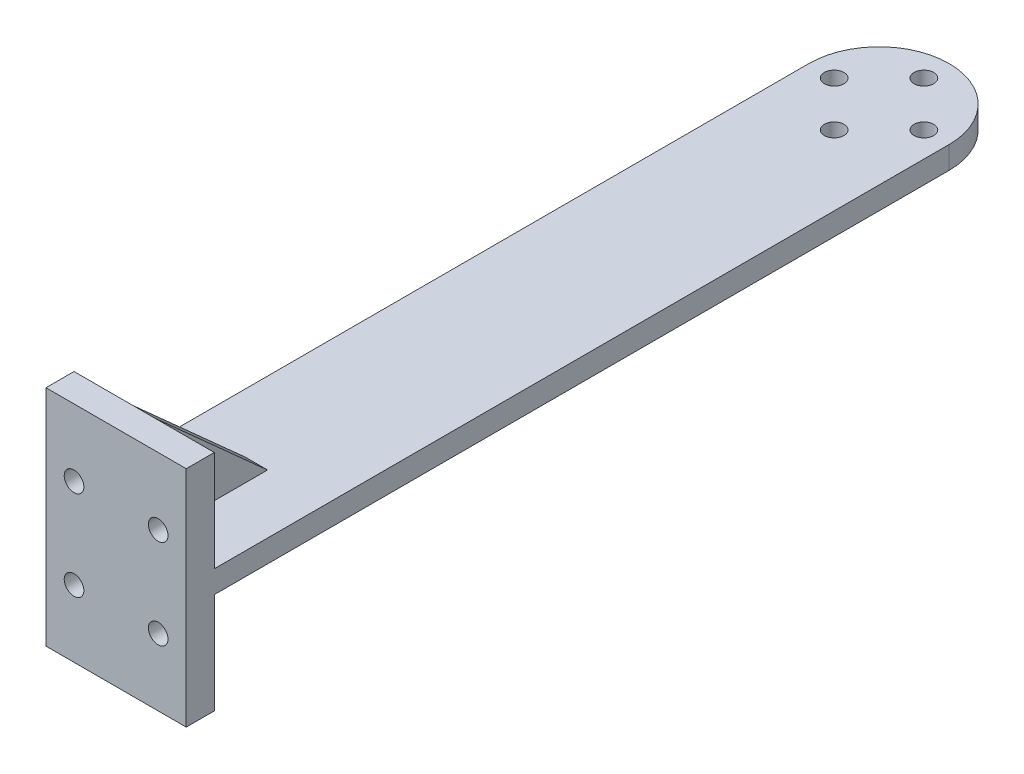
ISO-10303-21;
HEADER;
FILE_DESCRIPTION(('STEP AP214'),'2;1');
FILE_NAME('part.step','',(''),(''),'','','');
FILE_SCHEMA(('AUTOMOTIVE_DESIGN { 1 0 10303 214 1 1 1 1 }'));
ENDSEC;
DATA;
#1=APPLICATION_CONTEXT('core data for automotive mechanical design processes');
#2=APPLICATION_PROTOCOL_DEFINITION('international standard','automotive_design',2000,#1);
#3=PRODUCT_CONTEXT('',#1,'mechanical');
#4=PRODUCT('Part','Part','',(#3));
#5=PRODUCT_RELATED_PRODUCT_CATEGORY('part','',(#4));
#6=PRODUCT_DEFINITION_FORMATION('','',#4);
#7=PRODUCT_DEFINITION_CONTEXT('part definition',#1,'design');
#8=PRODUCT_DEFINITION('design','',#6,#7);
#9=PRODUCT_DEFINITION_SHAPE('','',#8);
#10=(LENGTH_UNIT() NAMED_UNIT(*) SI_UNIT(.MILLI.,.METRE.));
#11=(NAMED_UNIT(*) PLANE_ANGLE_UNIT() SI_UNIT($,.RADIAN.));
#12=(NAMED_UNIT(*) SI_UNIT($,.STERADIAN.) SOLID_ANGLE_UNIT());
#13=UNCERTAINTY_MEASURE_WITH_UNIT(LENGTH_MEASURE(1.E-05),#10,'distance_accuracy_value','');
#14=(GEOMETRIC_REPRESENTATION_CONTEXT(3) GLOBAL_UNCERTAINTY_ASSIGNED_CONTEXT((#13)) GLOBAL_UNIT_ASSIGNED_CONTEXT((#10,
#11,#12)) REPRESENTATION_CONTEXT('',''));
#15=CARTESIAN_POINT('',(0.,0.,0.));
#16=DIRECTION('',(0.,0.,1.));
#17=DIRECTION('',(1.,0.,0.));
#18=AXIS2_PLACEMENT_3D('',#15,#16,#17);
#19=CARTESIAN_POINT('',(0.,-17.95,0.));
#20=DIRECTION('',(0.,1.,0.));
#21=DIRECTION('',(0.,0.,-1.));
#22=AXIS2_PLACEMENT_3D('',#19,#20,#21);
#23=PLANE('',#22);
#24=DIRECTION('',(1.,0.,0.));
#25=VECTOR('',#24,1.);
#26=CARTESIAN_POINT('',(0.,-17.95,-5.));
#27=LINE('',#26,#25);
#28=CARTESIAN_POINT('',(10.5,-17.95,-5.));
#29=VERTEX_POINT('',#28);
#30=CARTESIAN_POINT('',(14.5,-17.95,-5.));
#31=VERTEX_POINT('',#30);
#32=EDGE_CURVE('E152',#29,#31,#27,.T.);
#33=ORIENTED_EDGE('',*,*,#32,.T.);
#34=DIRECTION('',(-1.,0.,0.));
#35=VECTOR('',#34,1.);
#36=CARTESIAN_POINT('',(0.,-17.95,-5.));
#37=LINE('',#36,#35);
#38=CARTESIAN_POINT('',(25.,-17.95,-5.));
#39=VERTEX_POINT('',#38);
#40=EDGE_CURVE('E181',#39,#31,#37,.T.);
#41=ORIENTED_EDGE('',*,*,#40,.F.);
#42=DIRECTION('',(0.,0.,-1.));
#43=VECTOR('',#42,1.);
#44=CARTESIAN_POINT('',(25.,-17.95,0.));
#45=LINE('',#44,#43);
#46=CARTESIAN_POINT('',(25.,-17.95,0.));
#47=VERTEX_POINT('',#46);
#48=EDGE_CURVE('E184',#47,#39,#45,.T.);
#49=ORIENTED_EDGE('',*,*,#48,.F.);
#50=DIRECTION('',(1.,0.,0.));
#51=VECTOR('',#50,1.);
#52=CARTESIAN_POINT('',(0.,-17.95,0.));
#53=LINE('',#52,#51);
#54=CARTESIAN_POINT('',(0.,-17.95,0.));
#55=VERTEX_POINT('',#54);
#56=EDGE_CURVE('E187',#55,#47,#53,.T.);
#57=ORIENTED_EDGE('',*,*,#56,.F.);
#58=DIRECTION('',(0.,0.,1.));
#59=VECTOR('',#58,1.);
#60=CARTESIAN_POINT('',(0.,-17.95,0.));
#61=LINE('',#60,#59);
#62=CARTESIAN_POINT('',(0.,-17.95,-5.));
#63=VERTEX_POINT('',#62);
#64=EDGE_CURVE('E177',#63,#55,#61,.T.);
#65=ORIENTED_EDGE('',*,*,#64,.F.);
#66=EDGE_CURVE('E180',#29,#63,#37,.T.);
#67=ORIENTED_EDGE('',*,*,#66,.F.);
#68=EDGE_LOOP('',(#33,#41,#49,#57,#65,#67));
#69=FACE_BOUND('',#68,.T.);
#70=ADVANCED_FACE('F38',(#69),#23,.F.);
#71=CARTESIAN_POINT('',(14.5,-17.95,-25.));
#72=DIRECTION('',(1.,0.,0.));
#73=DIRECTION('',(0.,1.,0.));
#74=AXIS2_PLACEMENT_3D('',#71,#72,#73);
#75=PLANE('',#74);
#76=DIRECTION('',(0.,1.,0.));
#77=VECTOR('',#76,1.);
#78=CARTESIAN_POINT('',(14.5,-17.95,-5.));
#79=LINE('',#78,#77);
#80=CARTESIAN_POINT('',(14.5,0.,-5.));
#81=VERTEX_POINT('',#80);
#82=EDGE_CURVE('E151',#31,#81,#79,.T.);
#83=ORIENTED_EDGE('',*,*,#82,.F.);
#84=DIRECTION('',(0.,0.667936165722797,-0.74421856905047));
#85=VECTOR('',#84,1.);
#86=CARTESIAN_POINT('',(14.5,0.,-25.));
#87=LINE('',#86,#85);
#88=CARTESIAN_POINT('',(14.5,0.,-25.));
#89=VERTEX_POINT('',#88);
#90=EDGE_CURVE('E141',#31,#89,#87,.T.);
#91=ORIENTED_EDGE('',*,*,#90,.T.);
#92=DIRECTION('',(0.,0.,1.));
#93=VECTOR('',#92,1.);
#94=CARTESIAN_POINT('',(14.5,0.,-25.));
#95=LINE('',#94,#93);
#96=EDGE_CURVE('E144',#89,#81,#95,.T.);
#97=ORIENTED_EDGE('',*,*,#96,.T.);
#98=EDGE_LOOP('',(#83,#91,#97));
#99=FACE_BOUND('',#98,.T.);
#100=ADVANCED_FACE('F150',(#99),#75,.T.);
#101=CARTESIAN_POINT('',(10.5,-17.95,-25.));
#102=DIRECTION('',(-1.,0.,0.));
#103=DIRECTION('',(0.,0.,1.));
#104=AXIS2_PLACEMENT_3D('',#101,#102,#103);
#105=PLANE('',#104);
#106=DIRECTION('',(0.,0.,1.));
#107=VECTOR('',#106,1.);
#108=CARTESIAN_POINT('',(10.5,0.,-25.));
#109=LINE('',#108,#107);
#110=CARTESIAN_POINT('',(10.5,0.,-25.));
#111=VERTEX_POINT('',#110);
#112=CARTESIAN_POINT('',(10.5,0.,-5.));
#113=VERTEX_POINT('',#112);
#114=EDGE_CURVE('E62',#111,#113,#109,.T.);
#115=ORIENTED_EDGE('',*,*,#114,.F.);
#116=DIRECTION('',(0.,-0.667936165722797,0.74421856905047));
#117=VECTOR('',#116,1.);
#118=CARTESIAN_POINT('',(10.5,-8.00819005057446,-16.0772255703906));
#119=LINE('',#118,#117);
#120=EDGE_CURVE('E55',#111,#29,#119,.T.);
#121=ORIENTED_EDGE('',*,*,#120,.T.);
#122=DIRECTION('',(0.,-1.,0.));
#123=VECTOR('',#122,1.);
#124=CARTESIAN_POINT('',(10.5,-17.95,-5.));
#125=LINE('',#124,#123);
#126=EDGE_CURVE('E145',#113,#29,#125,.T.);
#127=ORIENTED_EDGE('',*,*,#126,.F.);
#128=EDGE_LOOP('',(#115,#121,#127));
#129=FACE_BOUND('',#128,.T.);
#130=ADVANCED_FACE('F300',(#129),#105,.T.);
#131=CARTESIAN_POINT('',(0.,-17.95,-5.));
#132=DIRECTION('',(0.,0.,-1.));
#133=DIRECTION('',(-1.,0.,0.));
#134=AXIS2_PLACEMENT_3D('',#131,#132,#133);
#135=PLANE('',#134);
#136=ORIENTED_EDGE('',*,*,#82,.T.);
#137=DIRECTION('',(-1.,0.,0.));
#138=VECTOR('',#137,1.);
#139=CARTESIAN_POINT('',(0.,0.,-5.));
#140=LINE('',#139,#138);
#141=CARTESIAN_POINT('',(25.,0.,-5.));
#142=VERTEX_POINT('',#141);
#143=EDGE_CURVE('E158',#142,#81,#140,.T.);
#144=ORIENTED_EDGE('',*,*,#143,.F.);
#145=DIRECTION('',(0.,1.,0.));
#146=VECTOR('',#145,1.);
#147=CARTESIAN_POINT('',(25.,-17.95,-5.));
#148=LINE('',#147,#146);
#149=EDGE_CURVE('E190',#39,#142,#148,.T.);
#150=ORIENTED_EDGE('',*,*,#149,.F.);
#151=ORIENTED_EDGE('',*,*,#40,.T.);
#152=EDGE_LOOP('',(#136,#144,#150,#151));
#153=FACE_BOUND('',#152,.T.);
#154=CARTESIAN_POINT('',(20.,-6.,-5.));
#155=DIRECTION('',(0.,0.,1.));
#156=DIRECTION('',(-1.,0.,0.));
#157=AXIS2_PLACEMENT_3D('',#154,#155,#156);
#158=CIRCLE('',#157,1.75);
#159=CARTESIAN_POINT('',(18.25,-6.,-5.));
#160=VERTEX_POINT('',#159);
#161=EDGE_CURVE('E169',#160,#160,#158,.T.);
#162=ORIENTED_EDGE('',*,*,#161,.T.);
#163=EDGE_LOOP('',(#162));
#164=FACE_BOUND('',#163,.T.);
#165=ADVANCED_FACE('F311',(#153,#164),#135,.T.);
#166=CARTESIAN_POINT('',(12.5,4.,-136.));
#167=DIRECTION('',(0.,1.,0.));
#168=DIRECTION('',(0.,0.,1.));
#169=AXIS2_PLACEMENT_3D('',#166,#167,#168);
#170=PLANE('',#169);
#171=CARTESIAN_POINT('',(12.5,4.,-144.));
#172=DIRECTION('',(0.,1.,0.));
#173=DIRECTION('',(0.,0.,1.));
#174=AXIS2_PLACEMENT_3D('',#171,#172,#173);
#175=CIRCLE('',#174,1.75);
#176=CARTESIAN_POINT('',(12.5,4.,-142.25));
#177=VERTEX_POINT('',#176);
#178=EDGE_CURVE('E272',#177,#177,#175,.T.);
#179=ORIENTED_EDGE('',*,*,#178,.F.);
#180=EDGE_LOOP('',(#179));
#181=FACE_BOUND('',#180,.T.);
#182=CARTESIAN_POINT('',(20.5,4.,-136.));
#183=DIRECTION('',(0.,1.,0.));
#184=DIRECTION('',(0.,0.,1.));
#185=AXIS2_PLACEMENT_3D('',#182,#183,#184);
#186=CIRCLE('',#185,1.75000000000001);
#187=CARTESIAN_POINT('',(20.5,4.,-134.25));
#188=VERTEX_POINT('',#187);
#189=EDGE_CURVE('E414',#188,#188,#186,.T.);
#190=ORIENTED_EDGE('',*,*,#189,.F.);
#191=EDGE_LOOP('',(#190));
#192=FACE_BOUND('',#191,.T.);
#193=CARTESIAN_POINT('',(12.5,4.,-128.));
#194=DIRECTION('',(0.,1.,0.));
#195=DIRECTION('',(0.,0.,1.));
#196=AXIS2_PLACEMENT_3D('',#193,#194,#195);
#197=CIRCLE('',#196,1.75);
#198=CARTESIAN_POINT('',(12.5,4.,-126.25));
#199=VERTEX_POINT('',#198);
#200=EDGE_CURVE('E411',#199,#199,#197,.T.);
#201=ORIENTED_EDGE('',*,*,#200,.F.);
#202=EDGE_LOOP('',(#201));
#203=FACE_BOUND('',#202,.T.);
#204=CARTESIAN_POINT('',(4.5,4.,-136.));
#205=DIRECTION('',(0.,1.,0.));
#206=DIRECTION('',(0.,0.,1.));
#207=AXIS2_PLACEMENT_3D('',#204,#205,#206);
#208=CIRCLE('',#207,1.75000000000001);
#209=CARTESIAN_POINT('',(4.5,4.,-134.25));
#210=VERTEX_POINT('',#209);
#211=EDGE_CURVE('E408',#210,#210,#208,.T.);
#212=ORIENTED_EDGE('',*,*,#211,.F.);
#213=EDGE_LOOP('',(#212));
#214=FACE_BOUND('',#213,.T.);
#215=DIRECTION('',(0.,0.,1.));
#216=VECTOR('',#215,1.);
#217=CARTESIAN_POINT('',(10.5,4.,-25.));
#218=LINE('',#217,#216);
#219=CARTESIAN_POINT('',(10.5,4.,-25.));
#220=VERTEX_POINT('',#219);
#221=CARTESIAN_POINT('',(10.5,4.,-5.));
#222=VERTEX_POINT('',#221);
#223=EDGE_CURVE('E206',#220,#222,#218,.T.);
#224=ORIENTED_EDGE('',*,*,#223,.F.);
#225=DIRECTION('',(-1.,0.,0.));
#226=VECTOR('',#225,1.);
#227=CARTESIAN_POINT('',(14.5,4.,-25.));
#228=LINE('',#227,#226);
#229=CARTESIAN_POINT('',(14.5,4.,-25.));
#230=VERTEX_POINT('',#229);
#231=EDGE_CURVE('E204',#230,#220,#228,.T.);
#232=ORIENTED_EDGE('',*,*,#231,.F.);
#233=DIRECTION('',(0.,0.,1.));
#234=VECTOR('',#233,1.);
#235=CARTESIAN_POINT('',(14.5,4.,-25.));
#236=LINE('',#235,#234);
#237=CARTESIAN_POINT('',(14.5,4.,-5.));
#238=VERTEX_POINT('',#237);
#239=EDGE_CURVE('E212',#230,#238,#236,.T.);
#240=ORIENTED_EDGE('',*,*,#239,.T.);
#241=DIRECTION('',(-1.,0.,0.));
#242=VECTOR('',#241,1.);
#243=CARTESIAN_POINT('',(0.,4.,-5.));
#244=LINE('',#243,#242);
#245=CARTESIAN_POINT('',(25.,4.,-5.));
#246=VERTEX_POINT('',#245);
#247=EDGE_CURVE('E232',#246,#238,#244,.T.);
#248=ORIENTED_EDGE('',*,*,#247,.F.);
#249=DIRECTION('',(0.,0.,-1.));
#250=VECTOR('',#249,1.);
#251=CARTESIAN_POINT('',(25.,4.,0.));
#252=LINE('',#251,#250);
#253=CARTESIAN_POINT('',(25.,4.,-136.));
#254=VERTEX_POINT('',#253);
#255=EDGE_CURVE('E252',#246,#254,#252,.T.);
#256=ORIENTED_EDGE('',*,*,#255,.T.);
#257=CARTESIAN_POINT('',(12.5,4.,-136.));
#258=DIRECTION('',(0.,1.,0.));
#259=DIRECTION('',(0.,0.,1.));
#260=AXIS2_PLACEMENT_3D('',#257,#258,#259);
#261=CIRCLE('',#260,12.5);
#262=CARTESIAN_POINT('',(0.,4.,-136.));
#263=VERTEX_POINT('',#262);
#264=EDGE_CURVE('E255',#254,#263,#261,.T.);
#265=ORIENTED_EDGE('',*,*,#264,.T.);
#266=DIRECTION('',(0.,0.,1.));
#267=VECTOR('',#266,1.);
#268=CARTESIAN_POINT('',(0.,4.,0.));
#269=LINE('',#268,#267);
#270=CARTESIAN_POINT('',(0.,4.,-5.));
#271=VERTEX_POINT('',#270);
#272=EDGE_CURVE('E250',#263,#271,#269,.T.);
#273=ORIENTED_EDGE('',*,*,#272,.T.);
#274=EDGE_CURVE('E219',#222,#271,#244,.T.);
#275=ORIENTED_EDGE('',*,*,#274,.F.);
#276=EDGE_LOOP('',(#224,#232,#240,#248,#256,#265,#273,#275));
#277=FACE_BOUND('',#276,.T.);
#278=ADVANCED_FACE('F339',(#181,#192,#203,#214,#277),#170,.T.);
#279=CARTESIAN_POINT('',(0.,21.95,-5.));
#280=DIRECTION('',(0.,0.,1.));
#281=DIRECTION('',(1.,0.,0.));
#282=AXIS2_PLACEMENT_3D('',#279,#280,#281);
#283=PLANE('',#282);
#284=CARTESIAN_POINT('',(20.,10.,-5.));
#285=DIRECTION('',(0.,0.,-1.));
#286=DIRECTION('',(-1.,0.,0.));
#287=AXIS2_PLACEMENT_3D('',#284,#285,#286);
#288=CIRCLE('',#287,1.75);
#289=CARTESIAN_POINT('',(18.25,10.,-5.));
#290=VERTEX_POINT('',#289);
#291=EDGE_CURVE('E220',#290,#290,#288,.T.);
#292=ORIENTED_EDGE('',*,*,#291,.F.);
#293=EDGE_LOOP('',(#292));
#294=FACE_BOUND('',#293,.T.);
#295=DIRECTION('',(0.,-1.,0.));
#296=VECTOR('',#295,1.);
#297=CARTESIAN_POINT('',(14.5,21.95,-5.));
#298=LINE('',#297,#296);
#299=CARTESIAN_POINT('',(14.5,21.95,-5.));
#300=VERTEX_POINT('',#299);
#301=EDGE_CURVE('E203',#300,#238,#298,.T.);
#302=ORIENTED_EDGE('',*,*,#301,.F.);
#303=DIRECTION('',(-1.,0.,0.));
#304=VECTOR('',#303,1.);
#305=CARTESIAN_POINT('',(0.,21.95,-5.));
#306=LINE('',#305,#304);
#307=CARTESIAN_POINT('',(25.,21.95,-5.));
#308=VERTEX_POINT('',#307);
#309=EDGE_CURVE('E238',#308,#300,#306,.T.);
#310=ORIENTED_EDGE('',*,*,#309,.F.);
#311=DIRECTION('',(0.,-1.,0.));
#312=VECTOR('',#311,1.);
#313=CARTESIAN_POINT('',(25.,21.95,-5.));
#314=LINE('',#313,#312);
#315=EDGE_CURVE('E246',#308,#246,#314,.T.);
#316=ORIENTED_EDGE('',*,*,#315,.T.);
#317=ORIENTED_EDGE('',*,*,#247,.T.);
#318=EDGE_LOOP('',(#302,#310,#316,#317));
#319=FACE_BOUND('',#318,.T.);
#320=ADVANCED_FACE('F335',(#294,#319),#283,.F.);
#321=CARTESIAN_POINT('',(5.,10.,-5.));
#322=DIRECTION('',(0.,0.,-1.));
#323=DIRECTION('',(1.,0.,0.));
#324=AXIS2_PLACEMENT_3D('',#321,#322,#323);
#325=CIRCLE('',#324,1.75);
#326=CARTESIAN_POINT('',(6.75,10.,-5.));
#327=VERTEX_POINT('',#326);
#328=EDGE_CURVE('E215',#327,#327,#325,.T.);
#329=ORIENTED_EDGE('',*,*,#328,.F.);
#330=EDGE_LOOP('',(#329));
#331=FACE_BOUND('',#330,.T.);
#332=DIRECTION('',(0.,1.,0.));
#333=VECTOR('',#332,1.);
#334=CARTESIAN_POINT('',(10.5,21.95,-5.));
#335=LINE('',#334,#333);
#336=CARTESIAN_POINT('',(10.5,21.95,-5.));
#337=VERTEX_POINT('',#336);
#338=EDGE_CURVE('E207',#222,#337,#335,.T.);
#339=ORIENTED_EDGE('',*,*,#338,.F.);
#340=ORIENTED_EDGE('',*,*,#274,.T.);
#341=DIRECTION('',(0.,-1.,0.));
#342=VECTOR('',#341,1.);
#343=CARTESIAN_POINT('',(0.,21.95,-5.));
#344=LINE('',#343,#342);
#345=CARTESIAN_POINT('',(0.,21.95,-5.));
#346=VERTEX_POINT('',#345);
#347=EDGE_CURVE('E241',#346,#271,#344,.T.);
#348=ORIENTED_EDGE('',*,*,#347,.F.);
#349=EDGE_CURVE('E237',#337,#346,#306,.T.);
#350=ORIENTED_EDGE('',*,*,#349,.F.);
#351=EDGE_LOOP('',(#339,#340,#348,#350));
#352=FACE_BOUND('',#351,.T.);
#353=ADVANCED_FACE('F338',(#331,#352),#283,.F.);
#354=CARTESIAN_POINT('',(0.,4.,0.));
#355=DIRECTION('',(1.,0.,0.));
#356=DIRECTION('',(0.,0.,-1.));
#357=AXIS2_PLACEMENT_3D('',#354,#355,#356);
#358=PLANE('',#357);
#359=DIRECTION('',(0.,0.,1.));
#360=VECTOR('',#359,1.);
#361=CARTESIAN_POINT('',(0.,0.,0.));
#362=LINE('',#361,#360);
#363=CARTESIAN_POINT('',(0.,0.,-136.));
#364=VERTEX_POINT('',#363);
#365=CARTESIAN_POINT('',(0.,0.,-5.));
#366=VERTEX_POINT('',#365);
#367=EDGE_CURVE('E249',#364,#366,#362,.T.);
#368=ORIENTED_EDGE('',*,*,#367,.T.);
#369=DIRECTION('',(0.,1.,0.));
#370=VECTOR('',#369,1.);
#371=CARTESIAN_POINT('',(0.,-17.95,-5.));
#372=LINE('',#371,#370);
#373=EDGE_CURVE('E193',#63,#366,#372,.T.);
#374=ORIENTED_EDGE('',*,*,#373,.F.);
#375=ORIENTED_EDGE('',*,*,#64,.T.);
#376=DIRECTION('',(0.,-1.,0.));
#377=VECTOR('',#376,1.);
#378=CARTESIAN_POINT('',(0.,4.,0.));
#379=LINE('',#378,#377);
#380=CARTESIAN_POINT('',(0.,21.95,0.));
#381=VERTEX_POINT('',#380);
#382=EDGE_CURVE('E11',#381,#55,#379,.T.);
#383=ORIENTED_EDGE('',*,*,#382,.F.);
#384=DIRECTION('',(0.,0.,1.));
#385=VECTOR('',#384,1.);
#386=CARTESIAN_POINT('',(0.,21.95,0.));
#387=LINE('',#386,#385);
#388=EDGE_CURVE('E228',#346,#381,#387,.T.);
#389=ORIENTED_EDGE('',*,*,#388,.F.);
#390=ORIENTED_EDGE('',*,*,#347,.T.);
#391=ORIENTED_EDGE('',*,*,#272,.F.);
#392=DIRECTION('',(0.,-1.,0.));
#393=VECTOR('',#392,1.);
#394=CARTESIAN_POINT('',(0.,4.,-136.));
#395=LINE('',#394,#393);
#396=EDGE_CURVE('E257',#263,#364,#395,.T.);
#397=ORIENTED_EDGE('',*,*,#396,.T.);
#398=EDGE_LOOP('',(#368,#374,#375,#383,#389,#390,#391,#397));
#399=FACE_BOUND('',#398,.T.);
#400=ADVANCED_FACE('F40',(#399),#358,.F.);
#401=CARTESIAN_POINT('',(0.,4.,0.));
#402=DIRECTION('',(0.,0.,-1.));
#403=DIRECTION('',(-1.,0.,0.));
#404=AXIS2_PLACEMENT_3D('',#401,#402,#403);
#405=PLANE('',#404);
#406=CARTESIAN_POINT('',(20.,-6.,0.));
#407=DIRECTION('',(0.,0.,1.));
#408=DIRECTION('',(-1.,0.,0.));
#409=AXIS2_PLACEMENT_3D('',#406,#407,#408);
#410=CIRCLE('',#409,1.75);
#411=CARTESIAN_POINT('',(18.25,-6.,0.));
#412=VERTEX_POINT('',#411);
#413=EDGE_CURVE('E165',#412,#412,#410,.T.);
#414=ORIENTED_EDGE('',*,*,#413,.F.);
#415=EDGE_LOOP('',(#414));
#416=FACE_BOUND('',#415,.T.);
#417=CARTESIAN_POINT('',(5.,-6.,0.));
#418=DIRECTION('',(0.,0.,1.));
#419=DIRECTION('',(1.,0.,0.));
#420=AXIS2_PLACEMENT_3D('',#417,#418,#419);
#421=CIRCLE('',#420,1.75);
#422=CARTESIAN_POINT('',(6.75,-6.,0.));
#423=VERTEX_POINT('',#422);
#424=EDGE_CURVE('E172',#423,#423,#421,.T.);
#425=ORIENTED_EDGE('',*,*,#424,.F.);
#426=EDGE_LOOP('',(#425));
#427=FACE_BOUND('',#426,.T.);
#428=CARTESIAN_POINT('',(20.,10.,0.));
#429=DIRECTION('',(0.,0.,-1.));
#430=DIRECTION('',(-1.,0.,0.));
#431=AXIS2_PLACEMENT_3D('',#428,#429,#430);
#432=CIRCLE('',#431,1.75);
#433=CARTESIAN_POINT('',(18.25,10.,0.));
#434=VERTEX_POINT('',#433);
#435=EDGE_CURVE('E216',#434,#434,#432,.T.);
#436=ORIENTED_EDGE('',*,*,#435,.T.);
#437=EDGE_LOOP('',(#436));
#438=FACE_BOUND('',#437,.T.);
#439=CARTESIAN_POINT('',(5.,10.,0.));
#440=DIRECTION('',(0.,0.,-1.));
#441=DIRECTION('',(1.,0.,0.));
#442=AXIS2_PLACEMENT_3D('',#439,#440,#441);
#443=CIRCLE('',#442,1.75);
#444=CARTESIAN_POINT('',(6.75,10.,0.));
#445=VERTEX_POINT('',#444);
#446=EDGE_CURVE('E223',#445,#445,#443,.T.);
#447=ORIENTED_EDGE('',*,*,#446,.T.);
#448=EDGE_LOOP('',(#447));
#449=FACE_BOUND('',#448,.T.);
#450=ORIENTED_EDGE('',*,*,#382,.T.);
#451=ORIENTED_EDGE('',*,*,#56,.T.);
#452=DIRECTION('',(0.,-1.,0.));
#453=VECTOR('',#452,1.);
#454=CARTESIAN_POINT('',(25.,4.,0.));
#455=LINE('',#454,#453);
#456=CARTESIAN_POINT('',(25.,21.95,0.));
#457=VERTEX_POINT('',#456);
#458=EDGE_CURVE('E47',#457,#47,#455,.T.);
#459=ORIENTED_EDGE('',*,*,#458,.F.);
#460=DIRECTION('',(1.,0.,0.));
#461=VECTOR('',#460,1.);
#462=CARTESIAN_POINT('',(0.,21.95,0.));
#463=LINE('',#462,#461);
#464=EDGE_CURVE('E231',#381,#457,#463,.T.);
#465=ORIENTED_EDGE('',*,*,#464,.F.);
#466=EDGE_LOOP('',(#450,#451,#459,#465));
#467=FACE_BOUND('',#466,.T.);
#468=ADVANCED_FACE('F352',(#416,#427,#438,#449,#467),#405,.F.);
#469=CARTESIAN_POINT('',(25.,4.,0.));
#470=DIRECTION('',(-1.,0.,0.));
#471=DIRECTION('',(0.,0.,1.));
#472=AXIS2_PLACEMENT_3D('',#469,#470,#471);
#473=PLANE('',#472);
#474=ORIENTED_EDGE('',*,*,#458,.T.);
#475=ORIENTED_EDGE('',*,*,#48,.T.);
#476=ORIENTED_EDGE('',*,*,#149,.T.);
#477=DIRECTION('',(0.,0.,-1.));
#478=VECTOR('',#477,1.);
#479=CARTESIAN_POINT('',(25.,0.,0.));
#480=LINE('',#479,#478);
#481=CARTESIAN_POINT('',(25.,0.,-136.));
#482=VERTEX_POINT('',#481);
#483=EDGE_CURVE('E259',#142,#482,#480,.T.);
#484=ORIENTED_EDGE('',*,*,#483,.T.);
#485=DIRECTION('',(0.,-1.,0.));
#486=VECTOR('',#485,1.);
#487=CARTESIAN_POINT('',(25.,4.,-136.));
#488=LINE('',#487,#486);
#489=EDGE_CURVE('E264',#254,#482,#488,.T.);
#490=ORIENTED_EDGE('',*,*,#489,.F.);
#491=ORIENTED_EDGE('',*,*,#255,.F.);
#492=ORIENTED_EDGE('',*,*,#315,.F.);
#493=DIRECTION('',(0.,0.,-1.));
#494=VECTOR('',#493,1.);
#495=CARTESIAN_POINT('',(25.,21.95,0.));
#496=LINE('',#495,#494);
#497=EDGE_CURVE('E235',#457,#308,#496,.T.);
#498=ORIENTED_EDGE('',*,*,#497,.F.);
#499=EDGE_LOOP('',(#474,#475,#476,#484,#490,#491,#492,#498));
#500=FACE_BOUND('',#499,.T.);
#501=ADVANCED_FACE('F349',(#500),#473,.F.);
#502=CARTESIAN_POINT('',(12.5,4.,-136.));
#503=DIRECTION('',(0.,-1.,0.));
#504=DIRECTION('',(0.,0.,-1.));
#505=AXIS2_PLACEMENT_3D('',#502,#503,#504);
#506=CYLINDRICAL_SURFACE('',#505,12.5);
#507=CARTESIAN_POINT('',(12.5,0.,-136.));
#508=DIRECTION('',(0.,1.,0.));
#509=DIRECTION('',(0.,0.,1.));
#510=AXIS2_PLACEMENT_3D('',#507,#508,#509);
#511=CIRCLE('',#510,12.5);
#512=EDGE_CURVE('E253',#482,#364,#511,.T.);
#513=ORIENTED_EDGE('',*,*,#512,.T.);
#514=ORIENTED_EDGE('',*,*,#396,.F.);
#515=ORIENTED_EDGE('',*,*,#264,.F.);
#516=ORIENTED_EDGE('',*,*,#489,.T.);
#517=EDGE_LOOP('',(#513,#514,#515,#516));
#518=FACE_BOUND('',#517,.T.);
#519=ADVANCED_FACE('F346',(#518),#506,.T.);
#520=CARTESIAN_POINT('',(12.5,0.,-136.));
#521=DIRECTION('',(0.,1.,0.));
#522=DIRECTION('',(0.,0.,1.));
#523=AXIS2_PLACEMENT_3D('',#520,#521,#522);
#524=PLANE('',#523);
#525=CARTESIAN_POINT('',(12.5,0.,-144.));
#526=DIRECTION('',(0.,1.,0.));
#527=DIRECTION('',(0.,0.,1.));
#528=AXIS2_PLACEMENT_3D('',#525,#526,#527);
#529=CIRCLE('',#528,1.75);
#530=CARTESIAN_POINT('',(12.5,0.,-142.25));
#531=VERTEX_POINT('',#530);
#532=EDGE_CURVE('E42',#531,#531,#529,.T.);
#533=ORIENTED_EDGE('',*,*,#532,.T.);
#534=EDGE_LOOP('',(#533));
#535=FACE_BOUND('',#534,.T.);
#536=CARTESIAN_POINT('',(20.5,0.,-136.));
#537=DIRECTION('',(0.,1.,0.));
#538=DIRECTION('',(0.,0.,1.));
#539=AXIS2_PLACEMENT_3D('',#536,#537,#538);
#540=CIRCLE('',#539,1.75000000000001);
#541=CARTESIAN_POINT('',(20.5,0.,-134.25));
#542=VERTEX_POINT('',#541);
#543=EDGE_CURVE('E274',#542,#542,#540,.T.);
#544=ORIENTED_EDGE('',*,*,#543,.T.);
#545=EDGE_LOOP('',(#544));
#546=FACE_BOUND('',#545,.T.);
#547=CARTESIAN_POINT('',(12.5,0.,-128.));
#548=DIRECTION('',(0.,1.,0.));
#549=DIRECTION('',(0.,0.,1.));
#550=AXIS2_PLACEMENT_3D('',#547,#548,#549);
#551=CIRCLE('',#550,1.75);
#552=CARTESIAN_POINT('',(12.5,0.,-126.25));
#553=VERTEX_POINT('',#552);
#554=EDGE_CURVE('E271',#553,#553,#551,.T.);
#555=ORIENTED_EDGE('',*,*,#554,.T.);
#556=EDGE_LOOP('',(#555));
#557=FACE_BOUND('',#556,.T.);
#558=CARTESIAN_POINT('',(4.5,0.,-136.));
#559=DIRECTION('',(0.,1.,0.));
#560=DIRECTION('',(0.,0.,1.));
#561=AXIS2_PLACEMENT_3D('',#558,#559,#560);
#562=CIRCLE('',#561,1.75000000000001);
#563=CARTESIAN_POINT('',(4.5,0.,-134.25));
#564=VERTEX_POINT('',#563);
#565=EDGE_CURVE('E268',#564,#564,#562,.T.);
#566=ORIENTED_EDGE('',*,*,#565,.T.);
#567=EDGE_LOOP('',(#566));
#568=FACE_BOUND('',#567,.T.);
#569=DIRECTION('',(-1.,0.,0.));
#570=VECTOR('',#569,1.);
#571=CARTESIAN_POINT('',(14.5,0.,-25.));
#572=LINE('',#571,#570);
#573=EDGE_CURVE('E138',#89,#111,#572,.T.);
#574=ORIENTED_EDGE('',*,*,#573,.T.);
#575=ORIENTED_EDGE('',*,*,#114,.T.);
#576=EDGE_CURVE('E168',#113,#366,#140,.T.);
#577=ORIENTED_EDGE('',*,*,#576,.T.);
#578=ORIENTED_EDGE('',*,*,#367,.F.);
#579=ORIENTED_EDGE('',*,*,#512,.F.);
#580=ORIENTED_EDGE('',*,*,#483,.F.);
#581=ORIENTED_EDGE('',*,*,#143,.T.);
#582=ORIENTED_EDGE('',*,*,#96,.F.);
#583=EDGE_LOOP('',(#574,#575,#577,#578,#579,#580,#581,#582));
#584=FACE_BOUND('',#583,.T.);
#585=ADVANCED_FACE('F155',(#535,#546,#557,#568,#584),#524,.F.);
#586=CARTESIAN_POINT('',(0.,21.95,0.));
#587=DIRECTION('',(0.,-1.,0.));
#588=DIRECTION('',(0.,0.,-1.));
#589=AXIS2_PLACEMENT_3D('',#586,#587,#588);
#590=PLANE('',#589);
#591=ORIENTED_EDGE('',*,*,#309,.T.);
#592=DIRECTION('',(1.,0.,0.));
#593=VECTOR('',#592,1.);
#594=CARTESIAN_POINT('',(0.,21.95,-5.));
#595=LINE('',#594,#593);
#596=EDGE_CURVE('E198',#337,#300,#595,.T.);
#597=ORIENTED_EDGE('',*,*,#596,.F.);
#598=ORIENTED_EDGE('',*,*,#349,.T.);
#599=ORIENTED_EDGE('',*,*,#388,.T.);
#600=ORIENTED_EDGE('',*,*,#464,.T.);
#601=ORIENTED_EDGE('',*,*,#497,.T.);
#602=EDGE_LOOP('',(#591,#597,#598,#599,#600,#601));
#603=FACE_BOUND('',#602,.T.);
#604=ADVANCED_FACE('F330',(#603),#590,.F.);
#605=CARTESIAN_POINT('',(5.,10.,0.));
#606=DIRECTION('',(0.,0.,-1.));
#607=DIRECTION('',(-1.,0.,0.));
#608=AXIS2_PLACEMENT_3D('',#605,#606,#607);
#609=CYLINDRICAL_SURFACE('',#608,1.75);
#610=ORIENTED_EDGE('',*,*,#446,.F.);
#611=EDGE_LOOP('',(#610));
#612=FACE_BOUND('',#611,.T.);
#613=ORIENTED_EDGE('',*,*,#328,.T.);
#614=EDGE_LOOP('',(#613));
#615=FACE_BOUND('',#614,.T.);
#616=ADVANCED_FACE('F326',(#612,#615),#609,.F.);
#617=CARTESIAN_POINT('',(20.,10.,0.));
#618=DIRECTION('',(0.,0.,-1.));
#619=DIRECTION('',(-1.,0.,0.));
#620=AXIS2_PLACEMENT_3D('',#617,#618,#619);
#621=CYLINDRICAL_SURFACE('',#620,1.75);
#622=ORIENTED_EDGE('',*,*,#435,.F.);
#623=EDGE_LOOP('',(#622));
#624=FACE_BOUND('',#623,.T.);
#625=ORIENTED_EDGE('',*,*,#291,.T.);
#626=EDGE_LOOP('',(#625));
#627=FACE_BOUND('',#626,.T.);
#628=ADVANCED_FACE('F322',(#624,#627),#621,.F.);
#629=CARTESIAN_POINT('',(14.5,21.95,-25.));
#630=DIRECTION('',(-1.,0.,0.));
#631=DIRECTION('',(0.,-1.,0.));
#632=AXIS2_PLACEMENT_3D('',#629,#630,#631);
#633=PLANE('',#632);
#634=ORIENTED_EDGE('',*,*,#239,.F.);
#635=DIRECTION('',(0.,-0.667936165722797,-0.74421856905047));
#636=VECTOR('',#635,1.);
#637=CARTESIAN_POINT('',(14.5,4.,-25.));
#638=LINE('',#637,#636);
#639=EDGE_CURVE('E196',#300,#230,#638,.T.);
#640=ORIENTED_EDGE('',*,*,#639,.F.);
#641=ORIENTED_EDGE('',*,*,#301,.T.);
#642=EDGE_LOOP('',(#634,#640,#641));
#643=FACE_BOUND('',#642,.T.);
#644=ADVANCED_FACE('F318',(#643),#633,.F.);
#645=CARTESIAN_POINT('',(10.5,21.95,-25.));
#646=DIRECTION('',(1.,0.,0.));
#647=DIRECTION('',(0.,0.,-1.));
#648=AXIS2_PLACEMENT_3D('',#645,#646,#647);
#649=PLANE('',#648);
#650=ORIENTED_EDGE('',*,*,#338,.T.);
#651=DIRECTION('',(0.,-0.667936165722797,-0.74421856905047));
#652=VECTOR('',#651,1.);
#653=CARTESIAN_POINT('',(10.5,12.0081900505745,-16.0772255703906));
#654=LINE('',#653,#652);
#655=EDGE_CURVE('E200',#337,#220,#654,.T.);
#656=ORIENTED_EDGE('',*,*,#655,.T.);
#657=ORIENTED_EDGE('',*,*,#223,.T.);
#658=EDGE_LOOP('',(#650,#656,#657));
#659=FACE_BOUND('',#658,.T.);
#660=ADVANCED_FACE('F314',(#659),#649,.F.);
#661=CARTESIAN_POINT('',(0.,4.00000000000001,-25.));
#662=DIRECTION('',(0.,-0.74421856905047,0.667936165722797));
#663=DIRECTION('',(0.,-0.667936165722797,-0.74421856905047));
#664=AXIS2_PLACEMENT_3D('',#661,#662,#663);
#665=PLANE('',#664);
#666=ORIENTED_EDGE('',*,*,#596,.T.);
#667=ORIENTED_EDGE('',*,*,#639,.T.);
#668=ORIENTED_EDGE('',*,*,#231,.T.);
#669=ORIENTED_EDGE('',*,*,#655,.F.);
#670=EDGE_LOOP('',(#666,#667,#668,#669));
#671=FACE_BOUND('',#670,.T.);
#672=ADVANCED_FACE('F309',(#671),#665,.F.);
#673=ORIENTED_EDGE('',*,*,#126,.T.);
#674=ORIENTED_EDGE('',*,*,#66,.T.);
#675=ORIENTED_EDGE('',*,*,#373,.T.);
#676=ORIENTED_EDGE('',*,*,#576,.F.);
#677=EDGE_LOOP('',(#673,#674,#675,#676));
#678=FACE_BOUND('',#677,.T.);
#679=CARTESIAN_POINT('',(5.,-6.,-5.));
#680=DIRECTION('',(0.,0.,1.));
#681=DIRECTION('',(1.,0.,0.));
#682=AXIS2_PLACEMENT_3D('',#679,#680,#681);
#683=CIRCLE('',#682,1.75);
#684=CARTESIAN_POINT('',(6.75,-6.,-5.));
#685=VERTEX_POINT('',#684);
#686=EDGE_CURVE('E160',#685,#685,#683,.T.);
#687=ORIENTED_EDGE('',*,*,#686,.T.);
#688=EDGE_LOOP('',(#687));
#689=FACE_BOUND('',#688,.T.);
#690=ADVANCED_FACE('F306',(#678,#689),#135,.T.);
#691=CARTESIAN_POINT('',(5.,-6.,0.));
#692=DIRECTION('',(0.,0.,-1.));
#693=DIRECTION('',(-1.,0.,0.));
#694=AXIS2_PLACEMENT_3D('',#691,#692,#693);
#695=CYLINDRICAL_SURFACE('',#694,1.75);
#696=ORIENTED_EDGE('',*,*,#424,.T.);
#697=EDGE_LOOP('',(#696));
#698=FACE_BOUND('',#697,.T.);
#699=ORIENTED_EDGE('',*,*,#686,.F.);
#700=EDGE_LOOP('',(#699));
#701=FACE_BOUND('',#700,.T.);
#702=ADVANCED_FACE('F304',(#698,#701),#695,.F.);
#703=CARTESIAN_POINT('',(20.,-6.,0.));
#704=DIRECTION('',(0.,0.,-1.));
#705=DIRECTION('',(-1.,0.,0.));
#706=AXIS2_PLACEMENT_3D('',#703,#704,#705);
#707=CYLINDRICAL_SURFACE('',#706,1.75);
#708=ORIENTED_EDGE('',*,*,#413,.T.);
#709=EDGE_LOOP('',(#708));
#710=FACE_BOUND('',#709,.T.);
#711=ORIENTED_EDGE('',*,*,#161,.F.);
#712=EDGE_LOOP('',(#711));
#713=FACE_BOUND('',#712,.T.);
#714=ADVANCED_FACE('F437',(#710,#713),#707,.F.);
#715=CARTESIAN_POINT('',(0.,0.,-25.));
#716=DIRECTION('',(0.,-0.74421856905047,-0.667936165722797));
#717=DIRECTION('',(0.,0.667936165722797,-0.74421856905047));
#718=AXIS2_PLACEMENT_3D('',#715,#716,#717);
#719=PLANE('',#718);
#720=ORIENTED_EDGE('',*,*,#573,.F.);
#721=ORIENTED_EDGE('',*,*,#90,.F.);
#722=ORIENTED_EDGE('',*,*,#32,.F.);
#723=ORIENTED_EDGE('',*,*,#120,.F.);
#724=EDGE_LOOP('',(#720,#721,#722,#723));
#725=FACE_BOUND('',#724,.T.);
#726=ADVANCED_FACE('F140',(#725),#719,.T.);
#727=CARTESIAN_POINT('',(4.5,-17.95,-136.));
#728=DIRECTION('',(0.,1.,0.));
#729=DIRECTION('',(0.,0.,1.));
#730=AXIS2_PLACEMENT_3D('',#727,#728,#729);
#731=CYLINDRICAL_SURFACE('',#730,1.75000000000001);
#732=ORIENTED_EDGE('',*,*,#211,.T.);
#733=EDGE_LOOP('',(#732));
#734=FACE_BOUND('',#733,.T.);
#735=ORIENTED_EDGE('',*,*,#565,.F.);
#736=EDGE_LOOP('',(#735));
#737=FACE_BOUND('',#736,.T.);
#738=ADVANCED_FACE('F425',(#734,#737),#731,.F.);
#739=CARTESIAN_POINT('',(12.5,-17.95,-128.));
#740=DIRECTION('',(0.,1.,0.));
#741=DIRECTION('',(0.,0.,1.));
#742=AXIS2_PLACEMENT_3D('',#739,#740,#741);
#743=CYLINDRICAL_SURFACE('',#742,1.75);
#744=ORIENTED_EDGE('',*,*,#200,.T.);
#745=EDGE_LOOP('',(#744));
#746=FACE_BOUND('',#745,.T.);
#747=ORIENTED_EDGE('',*,*,#554,.F.);
#748=EDGE_LOOP('',(#747));
#749=FACE_BOUND('',#748,.T.);
#750=ADVANCED_FACE('F290',(#746,#749),#743,.F.);
#751=CARTESIAN_POINT('',(20.5,-17.95,-136.));
#752=DIRECTION('',(0.,1.,0.));
#753=DIRECTION('',(0.,0.,1.));
#754=AXIS2_PLACEMENT_3D('',#751,#752,#753);
#755=CYLINDRICAL_SURFACE('',#754,1.75000000000001);
#756=ORIENTED_EDGE('',*,*,#189,.T.);
#757=EDGE_LOOP('',(#756));
#758=FACE_BOUND('',#757,.T.);
#759=ORIENTED_EDGE('',*,*,#543,.F.);
#760=EDGE_LOOP('',(#759));
#761=FACE_BOUND('',#760,.T.);
#762=ADVANCED_FACE('F284',(#758,#761),#755,.F.);
#763=CARTESIAN_POINT('',(12.5,-17.95,-144.));
#764=DIRECTION('',(0.,1.,0.));
#765=DIRECTION('',(0.,0.,1.));
#766=AXIS2_PLACEMENT_3D('',#763,#764,#765);
#767=CYLINDRICAL_SURFACE('',#766,1.75);
#768=ORIENTED_EDGE('',*,*,#178,.T.);
#769=EDGE_LOOP('',(#768));
#770=FACE_BOUND('',#769,.T.);
#771=ORIENTED_EDGE('',*,*,#532,.F.);
#772=EDGE_LOOP('',(#771));
#773=FACE_BOUND('',#772,.T.);
#774=ADVANCED_FACE('F282',(#770,#773),#767,.F.);
#775=CLOSED_SHELL('',(#70,#100,#130,#165,#278,#320,#353,#400,#468,#501,#519,#585,#604,#616,#628,
#644,#660,#672,#690,#702,#714,#726,#738,#750,#762,#774));
#776=MANIFOLD_SOLID_BREP('B2',#775);
#777=ADVANCED_BREP_SHAPE_REPRESENTATION('',(#18,#776),#14);
#778=SHAPE_DEFINITION_REPRESENTATION(#9,#777);
ENDSEC;
END-ISO-10303-21;
